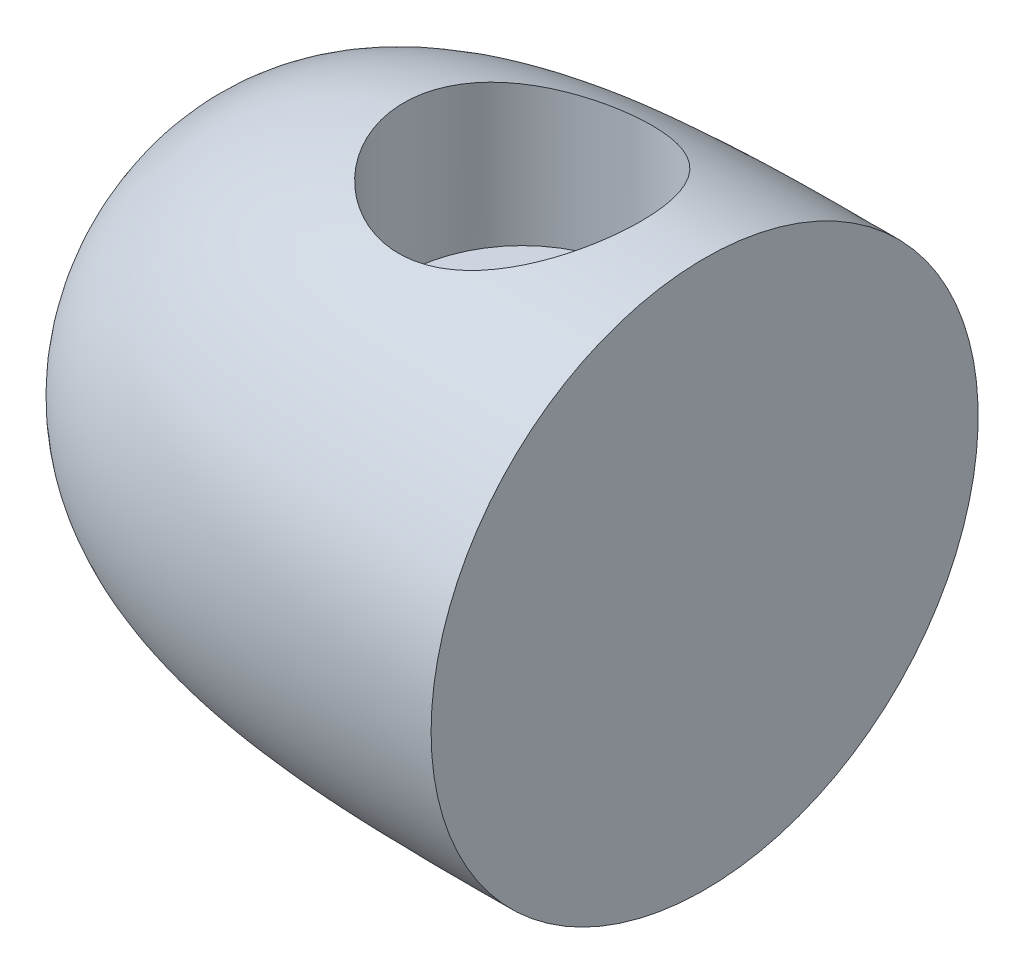
ISO-10303-21;
HEADER;
FILE_DESCRIPTION(('STEP AP214'),'2;1');
FILE_NAME('part.step','',(''),(''),'','','');
FILE_SCHEMA(('AUTOMOTIVE_DESIGN { 1 0 10303 214 1 1 1 1 }'));
ENDSEC;
DATA;
#1=APPLICATION_CONTEXT('core data for automotive mechanical design processes');
#2=APPLICATION_PROTOCOL_DEFINITION('international standard','automotive_design',2000,#1);
#3=PRODUCT_CONTEXT('',#1,'mechanical');
#4=PRODUCT('Part','Part','',(#3));
#5=PRODUCT_RELATED_PRODUCT_CATEGORY('part','',(#4));
#6=PRODUCT_DEFINITION_FORMATION('','',#4);
#7=PRODUCT_DEFINITION_CONTEXT('part definition',#1,'design');
#8=PRODUCT_DEFINITION('design','',#6,#7);
#9=PRODUCT_DEFINITION_SHAPE('','',#8);
#10=(LENGTH_UNIT() NAMED_UNIT(*) SI_UNIT(.MILLI.,.METRE.));
#11=(NAMED_UNIT(*) PLANE_ANGLE_UNIT() SI_UNIT($,.RADIAN.));
#12=(NAMED_UNIT(*) SI_UNIT($,.STERADIAN.) SOLID_ANGLE_UNIT());
#13=UNCERTAINTY_MEASURE_WITH_UNIT(LENGTH_MEASURE(1.E-05),#10,'distance_accuracy_value','');
#14=(GEOMETRIC_REPRESENTATION_CONTEXT(3) GLOBAL_UNCERTAINTY_ASSIGNED_CONTEXT((#13)) GLOBAL_UNIT_ASSIGNED_CONTEXT((#10,
#11,#12)) REPRESENTATION_CONTEXT('',''));
#15=CARTESIAN_POINT('',(0.,0.,0.));
#16=DIRECTION('',(0.,0.,1.));
#17=DIRECTION('',(1.,0.,0.));
#18=AXIS2_PLACEMENT_3D('',#15,#16,#17);
#19=CARTESIAN_POINT('',(0.,19.05,0.));
#20=CARTESIAN_POINT('',(-17.2371600378459,19.05,0.));
#21=CARTESIAN_POINT('',(-38.1,19.5116342305917,0.));
#22=CARTESIAN_POINT('',(-38.1,0.,0.));
#23=B_SPLINE_CURVE_WITH_KNOTS('',3,(#19,#20,#21,#22),.UNSPECIFIED.,.F.,.F.,(4,4),(0.,1.),.UNSPECIFIED.);
#24=CARTESIAN_POINT('',(-71.9484978540773,0.,0.));
#25=DIRECTION('',(-1.,0.,0.));
#26=AXIS1_PLACEMENT('',#24,#25);
#27=SURFACE_OF_REVOLUTION('',#23,#26);
#28=CARTESIAN_POINT('',(-37.,0.,0.));
#29=DIRECTION('',(-1.,0.,0.));
#30=DIRECTION('',(0.,0.,1.));
#31=AXIS2_PLACEMENT_3D('',#28,#29,#30);
#32=CIRCLE('',#31,6.91483115377596);
#33=CARTESIAN_POINT('',(-37.,0.,6.91483115377596));
#34=VERTEX_POINT('',#33);
#35=EDGE_CURVE('E40',#34,#34,#32,.F.);
#36=ORIENTED_EDGE('',*,*,#35,.T.);
#37=EDGE_LOOP('',(#36));
#38=FACE_BOUND('',#37,.T.);
#39=CARTESIAN_POINT('',(0.,0.,0.));
#40=DIRECTION('',(-1.,0.,0.));
#41=DIRECTION('',(0.,0.,1.));
#42=AXIS2_PLACEMENT_3D('',#39,#40,#41);
#43=CIRCLE('',#42,19.05);
#44=CARTESIAN_POINT('',(0.,0.,19.05));
#45=VERTEX_POINT('',#44);
#46=EDGE_CURVE('E10',#45,#45,#43,.T.);
#47=ORIENTED_EDGE('',*,*,#46,.T.);
#48=EDGE_LOOP('',(#47));
#49=FACE_BOUND('',#48,.T.);
#50=CARTESIAN_POINT('',(-4.445,19.0475109417089,0.));
#51=CARTESIAN_POINT('',(-4.44499918913441,19.0475115649416,-0.22039256769267));
#52=CARTESIAN_POINT('',(-4.453833741349,19.0436436764889,-0.440774119085682));
#53=CARTESIAN_POINT('',(-4.48906879955436,19.0282736217193,-0.879848167047794));
#54=CARTESIAN_POINT('',(-4.51546814026003,19.016771961843,-1.09854077469141));
#55=CARTESIAN_POINT('',(-4.58553962797228,18.9864270446485,-1.53260958751846));
#56=CARTESIAN_POINT('',(-4.6292112461137,18.9675840121183,-1.74798589403497));
#57=CARTESIAN_POINT('',(-4.73336774007698,18.923024469508,-2.17390487776963));
#58=CARTESIAN_POINT('',(-4.79385300834072,18.897307798993,-2.38444744204079));
#59=CARTESIAN_POINT('',(-4.93085230462689,18.8397002537025,-2.79872116535605));
#60=CARTESIAN_POINT('',(-5.00732199505706,18.8078264756877,-3.00246939476971));
#61=CARTESIAN_POINT('',(-5.17573288724153,18.7385839306637,-3.4025818379542));
#62=CARTESIAN_POINT('',(-5.26767985016475,18.7012131181266,-3.59894326868312));
#63=CARTESIAN_POINT('',(-5.46626041892388,18.6218234441075,-3.98306121362954));
#64=CARTESIAN_POINT('',(-5.57289162778467,18.5798053414434,-4.17081912558497));
#65=CARTESIAN_POINT('',(-5.80011267616988,18.4920013214727,-4.53684943449995));
#66=CARTESIAN_POINT('',(-5.92070759750848,18.44621403421,-4.71511834345611));
#67=CARTESIAN_POINT('',(-6.18114239153035,18.3495691849943,-5.06953353030249));
#68=CARTESIAN_POINT('',(-6.3216278747756,18.2985737698991,-5.24516793321129));
#69=CARTESIAN_POINT('',(-6.61613164638991,18.1946329141972,-5.58408237547562));
#70=CARTESIAN_POINT('',(-6.77015056533187,18.1416873827943,-5.74736183850834));
#71=CARTESIAN_POINT('',(-7.09090556568049,18.0349767840447,-6.0608079774033));
#72=CARTESIAN_POINT('',(-7.25764837937709,17.9812112950604,-6.21096762009543));
#73=CARTESIAN_POINT('',(-7.60281628939859,17.874078441313,-6.4972303247427));
#74=CARTESIAN_POINT('',(-7.78123775044182,17.8207109583677,-6.63333772714184));
#75=CARTESIAN_POINT('',(-8.16000199850054,17.7123472300902,-6.89855562929304));
#76=CARTESIAN_POINT('',(-8.36101793607483,17.6574474672273,-7.02674616421281));
#77=CARTESIAN_POINT('',(-8.77393645517288,17.5507943854294,-7.26552871048957));
#78=CARTESIAN_POINT('',(-8.98583487623477,17.4990398803169,-7.376127382072));
#79=CARTESIAN_POINT('',(-9.41929940986467,17.399982493431,-7.57887023225013));
#80=CARTESIAN_POINT('',(-9.64086566154814,17.3526796757461,-7.67101414518394));
#81=CARTESIAN_POINT('',(-10.0921962807476,17.2637685981401,-7.83594922780246));
#82=CARTESIAN_POINT('',(-10.3219602067209,17.2221600320974,-7.90874143802812));
#83=CARTESIAN_POINT('',(-10.78094154634,17.1468927125511,-8.03224663251585));
#84=CARTESIAN_POINT('',(-11.0099627511836,17.1130305424036,-8.08356418983812));
#85=CARTESIAN_POINT('',(-11.472474668823,17.052494090794,-8.16660284290698));
#86=CARTESIAN_POINT('',(-11.7059653103936,17.0258196948891,-8.19832425067137));
#87=CARTESIAN_POINT('',(-12.1754485549936,16.9802388056793,-8.24168779812698));
#88=CARTESIAN_POINT('',(-12.4114399236172,16.9613286477089,-8.25333941893247));
#89=CARTESIAN_POINT('',(-12.8840530944681,16.9315428163304,-8.25632981736066));
#90=CARTESIAN_POINT('',(-13.1206748587907,16.9206666703254,-8.24766978993102));
#91=CARTESIAN_POINT('',(-13.5754135042138,16.9074171261682,-8.2113869068948));
#92=CARTESIAN_POINT('',(-13.7936288994446,16.9044847329805,-8.18518353944798));
#93=CARTESIAN_POINT('',(-14.2272534444758,16.9052461836276,-8.11546294281837));
#94=CARTESIAN_POINT('',(-14.4426627430974,16.9089396746062,-8.0719466357187));
#95=CARTESIAN_POINT('',(-14.8691513711955,16.9224887881213,-7.96793523217168));
#96=CARTESIAN_POINT('',(-15.0802304305743,16.9323447938436,-7.90743908004479));
#97=CARTESIAN_POINT('',(-15.4966038520721,16.9575801407258,-7.76994867462046));
#98=CARTESIAN_POINT('',(-15.7018980847401,16.9729596053822,-7.69295405245667));
#99=CARTESIAN_POINT('',(-16.1050365595478,17.0084400276387,-7.52319817405465));
#100=CARTESIAN_POINT('',(-16.302892313813,17.028533308775,-7.43046261914158));
#101=CARTESIAN_POINT('',(-16.6903634383393,17.0726018699571,-7.22977500138734));
#102=CARTESIAN_POINT('',(-16.8799757850037,17.0965785594113,-7.12181741585147));
#103=CARTESIAN_POINT('',(-17.249781372657,17.1474940145919,-6.89144201828076));
#104=CARTESIAN_POINT('',(-17.4299745108874,17.1744328126235,-6.76902404853845));
#105=CARTESIAN_POINT('',(-17.7799309022047,17.2303367277564,-6.51050364586885));
#106=CARTESIAN_POINT('',(-17.9496937232547,17.2593019286878,-6.37440064670532));
#107=CARTESIAN_POINT('',(-18.2868291039321,17.3199424434608,-6.08152220438105));
#108=CARTESIAN_POINT('',(-18.4535625580564,17.3516793249535,-5.92402309721514));
#109=CARTESIAN_POINT('',(-18.7732724160362,17.4152926795878,-5.59578916263548));
#110=CARTESIAN_POINT('',(-18.9262543507411,17.4471690911518,-5.42505970836948));
#111=CARTESIAN_POINT('',(-19.2176444438587,17.5100795912814,-5.07127982147558));
#112=CARTESIAN_POINT('',(-19.3560446827983,17.5411132153983,-4.88822278116683));
#113=CARTESIAN_POINT('',(-19.6172011593159,17.6013610142699,-4.51109088085874));
#114=CARTESIAN_POINT('',(-19.7399633453903,17.6305758786801,-4.31702025112548));
#115=CARTESIAN_POINT('',(-19.9714166387269,17.6869121400466,-3.91490087670483));
#116=CARTESIAN_POINT('',(-20.0797631830639,17.713977565084,-3.70664572878601));
#117=CARTESIAN_POINT('',(-20.2784712674669,17.7645053361699,-3.28129546465112));
#118=CARTESIAN_POINT('',(-20.3688324724975,17.7879676150964,-3.06420018384951));
#119=CARTESIAN_POINT('',(-20.5308029764953,17.8305837271174,-2.62274987312112));
#120=CARTESIAN_POINT('',(-20.6024154137691,17.8497382811949,-2.398396065253));
#121=CARTESIAN_POINT('',(-20.7262771576123,17.8831744313907,-1.94405174292208));
#122=CARTESIAN_POINT('',(-20.7785270957221,17.8974561864425,-1.71406141256482));
#123=CARTESIAN_POINT('',(-20.8619574837379,17.9203868876422,-1.2569329235893));
#124=CARTESIAN_POINT('',(-20.8937056870334,17.9291873555161,-1.02990586980792));
#125=CARTESIAN_POINT('',(-20.9382158358028,17.9415516272874,-0.573856914229787));
#126=CARTESIAN_POINT('',(-20.9509781241509,17.945115525754,-0.344835048533273));
#127=CARTESIAN_POINT('',(-20.9574006322466,17.9469071666513,0.113467730427192));
#128=CARTESIAN_POINT('',(-20.9510632583779,17.9451355813043,0.342748607419747));
#129=CARTESIAN_POINT('',(-20.9193492357592,17.9363070719002,0.7998853116463));
#130=CARTESIAN_POINT('',(-20.8939727788253,17.9292502010916,1.02774115321401));
#131=CARTESIAN_POINT('',(-20.8252128372443,17.9102701589379,1.47511891674035));
#132=CARTESIAN_POINT('',(-20.7822580974059,17.8984629593642,1.69471185248161));
#133=CARTESIAN_POINT('',(-20.678757000125,17.8703077488654,2.12940818184024));
#134=CARTESIAN_POINT('',(-20.618210978439,17.8539598246071,2.34451166106178));
#135=CARTESIAN_POINT('',(-20.4800231885146,17.8171614562751,2.76875970273528));
#136=CARTESIAN_POINT('',(-20.4023835652832,17.7967115269739,2.97790500913859));
#137=CARTESIAN_POINT('',(-20.2305681751687,17.7522474818027,3.38898444190187));
#138=CARTESIAN_POINT('',(-20.1363861925694,17.7282320267292,3.59091582321951));
#139=CARTESIAN_POINT('',(-19.9304725053615,17.6768633397302,3.9895439194425));
#140=CARTESIAN_POINT('',(-19.8184725324297,17.6494608086513,4.18609568637543));
#141=CARTESIAN_POINT('',(-19.5788547607506,17.5924152479503,4.56918435799887));
#142=CARTESIAN_POINT('',(-19.4512315769437,17.5627714471539,4.7557177774785));
#143=CARTESIAN_POINT('',(-19.1812395805991,17.502110793459,5.11756977353873));
#144=CARTESIAN_POINT('',(-19.0388697387665,17.4710938448035,5.29288756590183));
#145=CARTESIAN_POINT('',(-18.7402935598359,17.4086206500852,5.63123326950807));
#146=CARTESIAN_POINT('',(-18.5840869834026,17.3771643964318,5.79426096807797));
#147=CARTESIAN_POINT('',(-18.2533715207932,17.3137625714609,6.11223722256988));
#148=CARTESIAN_POINT('',(-18.0784265351906,17.2818355566016,6.26673632644763));
#149=CARTESIAN_POINT('',(-17.7159607218573,17.2197148635066,6.56045407350586));
#150=CARTESIAN_POINT('',(-17.52844427086,17.1895205887457,6.69967799066526));
#151=CARTESIAN_POINT('',(-17.1419057798088,17.1319985203639,6.96197307881307));
#152=CARTESIAN_POINT('',(-16.94287936467,17.1046718280048,7.08503804867157));
#153=CARTESIAN_POINT('',(-16.5347840380591,17.054056682448,7.31397073543729));
#154=CARTESIAN_POINT('',(-16.3257194532652,17.0307665090225,7.4198457768887));
#155=CARTESIAN_POINT('',(-15.9006903360878,16.9894772239077,7.61279315403785));
#156=CARTESIAN_POINT('',(-15.6847976833601,16.9714357027205,7.70001459955209));
#157=CARTESIAN_POINT('',(-15.2460330898789,16.9413538060747,7.85601352326342));
#158=CARTESIAN_POINT('',(-15.0231611719176,16.9293134110203,7.9247910616858));
#159=CARTESIAN_POINT('',(-14.5722422913743,16.912049787965,8.04326109855244));
#160=CARTESIAN_POINT('',(-14.3441976724835,16.9068235329371,8.09296206440239));
#161=CARTESIAN_POINT('',(-13.8846733270722,16.9037793064354,8.17287910255282));
#162=CARTESIAN_POINT('',(-13.6531937775021,16.9059609546535,8.203096175026));
#163=CARTESIAN_POINT('',(-13.2013583302984,16.9177417698473,8.2427099230998));
#164=CARTESIAN_POINT('',(-12.9810824838996,16.9269308877364,8.25314998782827));
#165=CARTESIAN_POINT('',(-12.5408098753066,16.9522869953522,8.25640004398823));
#166=CARTESIAN_POINT('',(-12.3208131025069,16.9684537114282,8.24921072676507));
#167=CARTESIAN_POINT('',(-11.8827013641333,17.0075840501319,8.21737733416802));
#168=CARTESIAN_POINT('',(-11.6645863994239,17.0305476758815,8.19273325077647));
#169=CARTESIAN_POINT('',(-11.2317597216912,17.0828707820898,8.12632975096634));
#170=CARTESIAN_POINT('',(-11.0170480547061,17.1122303489907,8.08457010322137));
#171=CARTESIAN_POINT('',(-10.594572086637,17.1764279998918,7.98491286122909));
#172=CARTESIAN_POINT('',(-10.386759714838,17.2112082064455,7.92718125979846));
#173=CARTESIAN_POINT('',(-9.97702029730902,17.2857435167253,7.79594146572498));
#174=CARTESIAN_POINT('',(-9.77509536532016,17.3255003807296,7.72242768420435));
#175=CARTESIAN_POINT('',(-9.37833727411778,17.4091388639832,7.56025847399437));
#176=CARTESIAN_POINT('',(-9.18350340271074,17.4530200674082,7.4716045710285));
#177=CARTESIAN_POINT('',(-8.80183254962439,17.5440135325005,7.27976340178488));
#178=CARTESIAN_POINT('',(-8.61499848941355,17.5911269584784,7.17657088415791));
#179=CARTESIAN_POINT('',(-8.23817290557835,17.6908184458087,6.94900948939076));
#180=CARTESIAN_POINT('',(-8.04879648729507,17.7435516004521,6.82368912308005));
#181=CARTESIAN_POINT('',(-7.68124706038784,17.8503873593522,6.55809111016115));
#182=CARTESIAN_POINT('',(-7.5030745521581,17.9044900246236,6.41781279624739));
#183=CARTESIAN_POINT('',(-7.15880018243751,18.0128814995295,6.12303110664265));
#184=CARTESIAN_POINT('',(-6.99270472487434,18.0671703921648,5.96852028109734));
#185=CARTESIAN_POINT('',(-6.67367659992591,18.1746777681423,5.64622434758515));
#186=CARTESIAN_POINT('',(-6.52073959781389,18.2278965995282,5.47844364627676));
#187=CARTESIAN_POINT('',(-6.22144886835608,18.3347487976924,5.12155826840507));
#188=CARTESIAN_POINT('',(-6.07582810508315,18.3882650128855,4.93180257542112));
#189=CARTESIAN_POINT('',(-5.80122582278976,18.4914484053746,4.5397352902351));
#190=CARTESIAN_POINT('',(-5.6722377351595,18.5411170990285,4.33742870169811));
#191=CARTESIAN_POINT('',(-5.4319101364892,18.6353419376836,3.92142787315056));
#192=CARTESIAN_POINT('',(-5.32057165502912,18.679897784388,3.70773296977988));
#193=CARTESIAN_POINT('',(-5.11661873516258,18.7626875173236,3.27040636540592));
#194=CARTESIAN_POINT('',(-5.02400355138007,18.8009216552116,3.04677506040411));
#195=CARTESIAN_POINT('',(-4.8598859333071,18.8694067379246,2.59507139049438));
#196=CARTESIAN_POINT('',(-4.78805281156714,18.8997818028615,2.36713817368601));
#197=CARTESIAN_POINT('',(-4.66425867166705,18.9525188423919,1.90501947465593));
#198=CARTESIAN_POINT('',(-4.61229759436985,18.9748808408313,1.67083401104246));
#199=CARTESIAN_POINT('',(-4.52891305432265,19.0109241201378,1.19828934706651));
#200=CARTESIAN_POINT('',(-4.49747955610692,19.0246096426406,0.959932244733922));
#201=CARTESIAN_POINT('',(-4.45552427962067,19.0429023624861,0.481045608719436));
#202=CARTESIAN_POINT('',(-4.44500088490438,19.0475102615699,0.240516244407388));
#203=CARTESIAN_POINT('',(-4.445,19.0475109417089,0.));
#204=B_SPLINE_CURVE_WITH_KNOTS('',3,(#50,#51,#52,#53,#54,#55,#56,#57,#58,#59,#60,#61,#62,#63,
#64,#65,#66,#67,#68,#69,#70,#71,#72,#73,#74,#75,#76,#77,#78,#79,#80,#81,#82,#83,#84,#85,#86,#87,
#88,#89,#90,#91,#92,#93,#94,#95,#96,#97,#98,#99,#100,#101,#102,#103,#104,#105,#106,#107,#108,
#109,#110,#111,#112,#113,#114,#115,#116,#117,#118,#119,#120,#121,#122,#123,#124,#125,#126,#127,
#128,#129,#130,#131,#132,#133,#134,#135,#136,#137,#138,#139,#140,#141,#142,#143,#144,#145,#146,
#147,#148,#149,#150,#151,#152,#153,#154,#155,#156,#157,#158,#159,#160,#161,#162,#163,#164,#165,
#166,#167,#168,#169,#170,#171,#172,#173,#174,#175,#176,#177,#178,#179,#180,#181,#182,#183,#184,
#185,#186,#187,#188,#189,#190,#191,#192,#193,#194,#195,#196,#197,#198,#199,#200,#201,#202,#203),
.UNSPECIFIED.,.T.,.F.,(4,2,2,2,2,2,2,2,2,2,2,2,2,2,2,2,2,2,2,2,2,2,2,2,2,2,2,2,2,2,2,2,2,2,2,2,
2,2,2,2,2,2,2,2,2,2,2,2,2,2,2,2,2,2,2,2,2,2,2,2,2,2,2,2,2,2,2,2,2,2,2,2,2,2,2,2,4),(0.,
0.660949002708811,1.32185416103922,1.98273908447864,2.64363943471085,3.30273034435258,
3.96206713485417,4.62129642615711,5.28076638933978,5.97186543412383,6.66299669686449,
7.35449621130061,8.04578149289752,8.77884430009694,9.51162890795993,10.2444240637231,
10.9771798091219,11.6876333670351,12.3980756125282,13.1081821477634,13.8182469080103,
14.4768613389084,15.1354406968507,15.7940610093969,16.452696048656,17.1102658545931,
17.7680748498179,18.4258910198844,19.0837344191753,19.7775747975083,20.471134853404,
21.1650696681595,21.8587397265494,22.5667937106879,23.2748608834033,23.9828094587489,
24.6907349411315,25.3781038787092,26.0654604026664,26.7527303295754,27.4399933324307,
28.1114077467715,28.7828093469834,29.4541267436887,30.1256969265805,30.8085501849146,
31.4916394775945,32.1747764810611,32.8579253031218,33.5638098766122,34.2694499611743,
34.9753600544136,35.6809685689406,36.380706411141,37.0804419684436,37.779866578091,
38.4792552811004,39.1405899492287,39.8018986831897,40.4632077209163,41.1245256968974,
41.7792134524598,42.4341334334328,43.08898745471,43.7440786186477,44.4426985906419,
45.1413497425949,45.840368696897,46.5391564879513,47.2735644318146,48.0076814476972,
48.7418412721414,49.475971863864,50.1976820196486,50.919390027685,51.640744944464,
52.3620440950688),.UNSPECIFIED.);
#205=CARTESIAN_POINT('',(-4.445,19.0475109417089,0.));
#206=VERTEX_POINT('',#205);
#207=EDGE_CURVE('E44',#206,#206,#204,.T.);
#208=ORIENTED_EDGE('',*,*,#207,.F.);
#209=EDGE_LOOP('',(#208));
#210=FACE_BOUND('',#209,.T.);
#211=ADVANCED_FACE('F35',(#38,#49,#210),#27,.T.);
#212=CARTESIAN_POINT('',(0.,0.,0.));
#213=DIRECTION('',(-1.,0.,0.));
#214=DIRECTION('',(0.,0.,1.));
#215=AXIS2_PLACEMENT_3D('',#212,#213,#214);
#216=PLANE('',#215);
#217=ORIENTED_EDGE('',*,*,#46,.F.);
#218=EDGE_LOOP('',(#217));
#219=FACE_BOUND('',#218,.T.);
#220=ADVANCED_FACE('F63',(#219),#216,.F.);
#221=CARTESIAN_POINT('',(-12.7,19.2808171152958,0.));
#222=DIRECTION('',(0.,-1.,0.));
#223=DIRECTION('',(0.,0.,-1.));
#224=AXIS2_PLACEMENT_3D('',#221,#222,#223);
#225=CYLINDRICAL_SURFACE('',#224,8.255);
#226=CARTESIAN_POINT('',(-12.7,7.62,0.));
#227=DIRECTION('',(0.,1.,0.));
#228=DIRECTION('',(0.,0.,1.));
#229=AXIS2_PLACEMENT_3D('',#226,#227,#228);
#230=CIRCLE('',#229,8.255);
#231=CARTESIAN_POINT('',(-12.7,7.62,8.255));
#232=VERTEX_POINT('',#231);
#233=EDGE_CURVE('E49',#232,#232,#230,.T.);
#234=ORIENTED_EDGE('',*,*,#233,.F.);
#235=EDGE_LOOP('',(#234));
#236=FACE_BOUND('',#235,.T.);
#237=ORIENTED_EDGE('',*,*,#207,.T.);
#238=EDGE_LOOP('',(#237));
#239=FACE_BOUND('',#238,.T.);
#240=ADVANCED_FACE('F58',(#236,#239),#225,.F.);
#241=CARTESIAN_POINT('',(-12.7,7.62,0.));
#242=DIRECTION('',(0.,1.,0.));
#243=DIRECTION('',(0.,0.,1.));
#244=AXIS2_PLACEMENT_3D('',#241,#242,#243);
#245=PLANE('',#244);
#246=ORIENTED_EDGE('',*,*,#233,.T.);
#247=EDGE_LOOP('',(#246));
#248=FACE_BOUND('',#247,.T.);
#249=ADVANCED_FACE('F62',(#248),#245,.T.);
#250=CARTESIAN_POINT('',(-37.,0.,0.));
#251=DIRECTION('',(1.,0.,0.));
#252=DIRECTION('',(0.,0.,-1.));
#253=AXIS2_PLACEMENT_3D('',#250,#251,#252);
#254=PLANE('',#253);
#255=ORIENTED_EDGE('',*,*,#35,.F.);
#256=EDGE_LOOP('',(#255));
#257=FACE_BOUND('',#256,.T.);
#258=ADVANCED_FACE('F84',(#257),#254,.F.);
#259=CLOSED_SHELL('',(#211,#220,#240,#249,#258));
#260=MANIFOLD_SOLID_BREP('B2',#259);
#261=ADVANCED_BREP_SHAPE_REPRESENTATION('',(#18,#260),#14);
#262=SHAPE_DEFINITION_REPRESENTATION(#9,#261);
ENDSEC;
END-ISO-10303-21;
